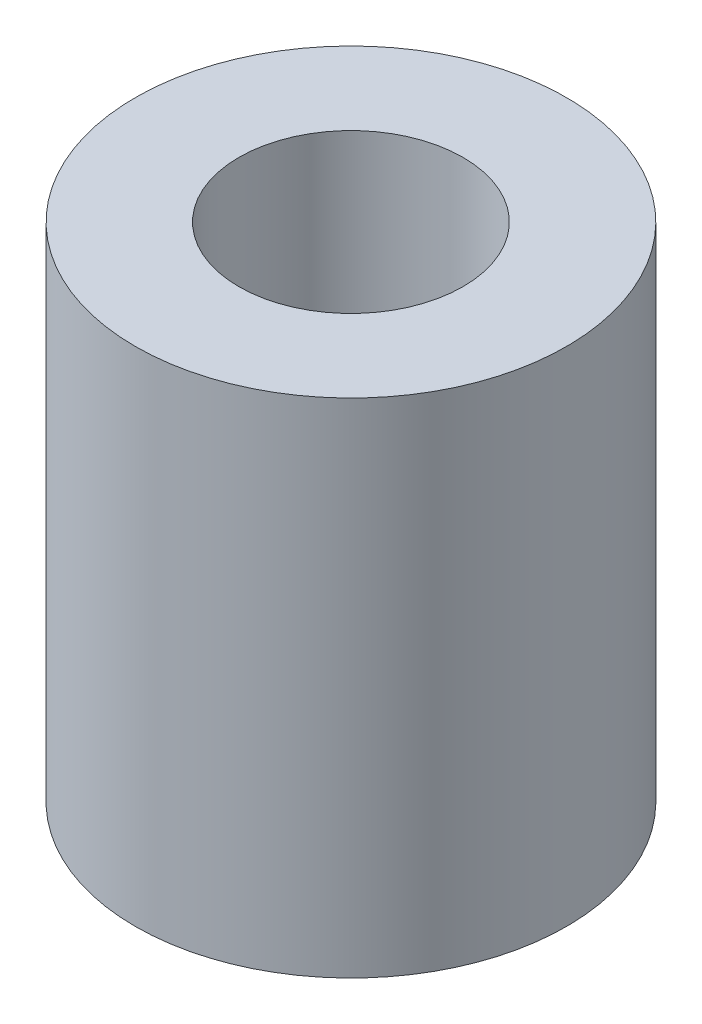
ISO-10303-21;
HEADER;
FILE_DESCRIPTION(('STEP AP214'),'2;1');
FILE_NAME('part.step','',(''),(''),'','','');
FILE_SCHEMA(('AUTOMOTIVE_DESIGN { 1 0 10303 214 1 1 1 1 }'));
ENDSEC;
DATA;
#1=APPLICATION_CONTEXT('core data for automotive mechanical design processes');
#2=APPLICATION_PROTOCOL_DEFINITION('international standard','automotive_design',2000,#1);
#3=PRODUCT_CONTEXT('',#1,'mechanical');
#4=PRODUCT('Part','Part','',(#3));
#5=PRODUCT_RELATED_PRODUCT_CATEGORY('part','',(#4));
#6=PRODUCT_DEFINITION_FORMATION('','',#4);
#7=PRODUCT_DEFINITION_CONTEXT('part definition',#1,'design');
#8=PRODUCT_DEFINITION('design','',#6,#7);
#9=PRODUCT_DEFINITION_SHAPE('','',#8);
#10=(LENGTH_UNIT() NAMED_UNIT(*) SI_UNIT(.MILLI.,.METRE.));
#11=(NAMED_UNIT(*) PLANE_ANGLE_UNIT() SI_UNIT($,.RADIAN.));
#12=(NAMED_UNIT(*) SI_UNIT($,.STERADIAN.) SOLID_ANGLE_UNIT());
#13=UNCERTAINTY_MEASURE_WITH_UNIT(LENGTH_MEASURE(1.E-05),#10,'distance_accuracy_value','');
#14=(GEOMETRIC_REPRESENTATION_CONTEXT(3) GLOBAL_UNCERTAINTY_ASSIGNED_CONTEXT((#13)) GLOBAL_UNIT_ASSIGNED_CONTEXT((#10,
#11,#12)) REPRESENTATION_CONTEXT('',''));
#15=CARTESIAN_POINT('',(0.,0.,0.));
#16=DIRECTION('',(0.,0.,1.));
#17=DIRECTION('',(1.,0.,0.));
#18=AXIS2_PLACEMENT_3D('',#15,#16,#17);
#19=CARTESIAN_POINT('',(0.,14.7955,0.));
#20=DIRECTION('',(0.,1.,0.));
#21=DIRECTION('',(0.,0.,1.));
#22=AXIS2_PLACEMENT_3D('',#19,#20,#21);
#23=PLANE('',#22);
#24=CARTESIAN_POINT('',(0.,14.7955,0.));
#25=DIRECTION('',(0.,1.,0.));
#26=DIRECTION('',(0.,0.,1.));
#27=AXIS2_PLACEMENT_3D('',#24,#25,#26);
#28=CIRCLE('',#27,6.35);
#29=CARTESIAN_POINT('',(0.,14.7955,6.35));
#30=VERTEX_POINT('',#29);
#31=EDGE_CURVE('E10',#30,#30,#28,.T.);
#32=ORIENTED_EDGE('',*,*,#31,.T.);
#33=EDGE_LOOP('',(#32));
#34=FACE_BOUND('',#33,.T.);
#35=CARTESIAN_POINT('',(0.,14.7955,0.));
#36=DIRECTION('',(0.,1.,0.));
#37=DIRECTION('',(0.,0.,1.));
#38=AXIS2_PLACEMENT_3D('',#35,#36,#37);
#39=CIRCLE('',#38,3.3);
#40=CARTESIAN_POINT('',(0.,14.7955,3.3));
#41=VERTEX_POINT('',#40);
#42=EDGE_CURVE('E50',#41,#41,#39,.T.);
#43=ORIENTED_EDGE('',*,*,#42,.F.);
#44=EDGE_LOOP('',(#43));
#45=FACE_BOUND('',#44,.T.);
#46=ADVANCED_FACE('F37',(#34,#45),#23,.T.);
#47=CARTESIAN_POINT('',(0.,0.,0.));
#48=DIRECTION('',(0.,1.,0.));
#49=DIRECTION('',(0.,0.,1.));
#50=AXIS2_PLACEMENT_3D('',#47,#48,#49);
#51=PLANE('',#50);
#52=CARTESIAN_POINT('',(0.,0.,0.));
#53=DIRECTION('',(0.,1.,0.));
#54=DIRECTION('',(0.,0.,1.));
#55=AXIS2_PLACEMENT_3D('',#52,#53,#54);
#56=CIRCLE('',#55,6.35);
#57=CARTESIAN_POINT('',(0.,0.,6.35));
#58=VERTEX_POINT('',#57);
#59=EDGE_CURVE('E41',#58,#58,#56,.T.);
#60=ORIENTED_EDGE('',*,*,#59,.F.);
#61=EDGE_LOOP('',(#60));
#62=FACE_BOUND('',#61,.T.);
#63=CARTESIAN_POINT('',(0.,0.,0.));
#64=DIRECTION('',(0.,1.,0.));
#65=DIRECTION('',(0.,0.,1.));
#66=AXIS2_PLACEMENT_3D('',#63,#64,#65);
#67=CIRCLE('',#66,3.3);
#68=CARTESIAN_POINT('',(0.,0.,3.3));
#69=VERTEX_POINT('',#68);
#70=EDGE_CURVE('E52',#69,#69,#67,.T.);
#71=ORIENTED_EDGE('',*,*,#70,.T.);
#72=EDGE_LOOP('',(#71));
#73=FACE_BOUND('',#72,.T.);
#74=ADVANCED_FACE('F64',(#62,#73),#51,.F.);
#75=CARTESIAN_POINT('',(0.,14.7955,0.));
#76=DIRECTION('',(0.,-1.,0.));
#77=DIRECTION('',(0.,0.,-1.));
#78=AXIS2_PLACEMENT_3D('',#75,#76,#77);
#79=CYLINDRICAL_SURFACE('',#78,6.35);
#80=ORIENTED_EDGE('',*,*,#31,.F.);
#81=EDGE_LOOP('',(#80));
#82=FACE_BOUND('',#81,.T.);
#83=ORIENTED_EDGE('',*,*,#59,.T.);
#84=EDGE_LOOP('',(#83));
#85=FACE_BOUND('',#84,.T.);
#86=ADVANCED_FACE('F39',(#82,#85),#79,.T.);
#87=CARTESIAN_POINT('',(0.,14.7955,0.));
#88=DIRECTION('',(0.,-1.,0.));
#89=DIRECTION('',(0.,0.,-1.));
#90=AXIS2_PLACEMENT_3D('',#87,#88,#89);
#91=CYLINDRICAL_SURFACE('',#90,3.3);
#92=ORIENTED_EDGE('',*,*,#42,.T.);
#93=EDGE_LOOP('',(#92));
#94=FACE_BOUND('',#93,.T.);
#95=ORIENTED_EDGE('',*,*,#70,.F.);
#96=EDGE_LOOP('',(#95));
#97=FACE_BOUND('',#96,.T.);
#98=ADVANCED_FACE('F60',(#94,#97),#91,.F.);
#99=CLOSED_SHELL('',(#46,#74,#86,#98));
#100=MANIFOLD_SOLID_BREP('B2',#99);
#101=ADVANCED_BREP_SHAPE_REPRESENTATION('',(#18,#100),#14);
#102=SHAPE_DEFINITION_REPRESENTATION(#9,#101);
ENDSEC;
END-ISO-10303-21;
